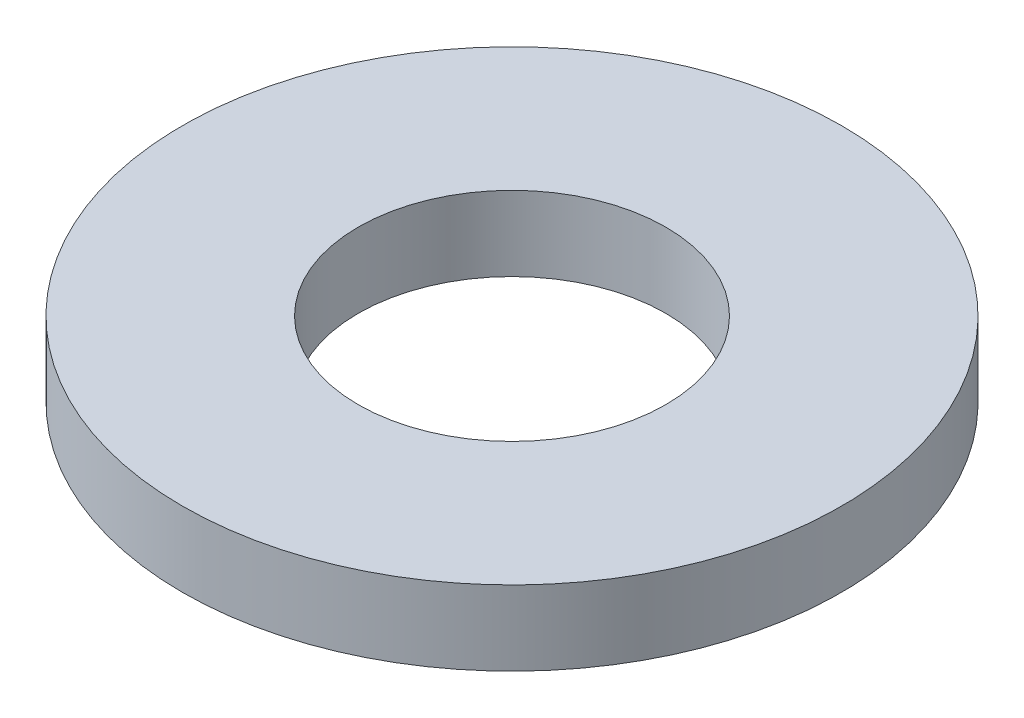
ISO-10303-21;
HEADER;
FILE_DESCRIPTION(('STEP AP214'),'2;1');
FILE_NAME('part.step','',(''),(''),'','','');
FILE_SCHEMA(('AUTOMOTIVE_DESIGN { 1 0 10303 214 1 1 1 1 }'));
ENDSEC;
DATA;
#1=APPLICATION_CONTEXT('core data for automotive mechanical design processes');
#2=APPLICATION_PROTOCOL_DEFINITION('international standard','automotive_design',2000,#1);
#3=PRODUCT_CONTEXT('',#1,'mechanical');
#4=PRODUCT('Part','Part','',(#3));
#5=PRODUCT_RELATED_PRODUCT_CATEGORY('part','',(#4));
#6=PRODUCT_DEFINITION_FORMATION('','',#4);
#7=PRODUCT_DEFINITION_CONTEXT('part definition',#1,'design');
#8=PRODUCT_DEFINITION('design','',#6,#7);
#9=PRODUCT_DEFINITION_SHAPE('','',#8);
#10=(LENGTH_UNIT() NAMED_UNIT(*) SI_UNIT(.MILLI.,.METRE.));
#11=(NAMED_UNIT(*) PLANE_ANGLE_UNIT() SI_UNIT($,.RADIAN.));
#12=(NAMED_UNIT(*) SI_UNIT($,.STERADIAN.) SOLID_ANGLE_UNIT());
#13=UNCERTAINTY_MEASURE_WITH_UNIT(LENGTH_MEASURE(1.E-05),#10,'distance_accuracy_value','');
#14=(GEOMETRIC_REPRESENTATION_CONTEXT(3) GLOBAL_UNCERTAINTY_ASSIGNED_CONTEXT((#13)) GLOBAL_UNIT_ASSIGNED_CONTEXT((#10,
#11,#12)) REPRESENTATION_CONTEXT('',''));
#15=CARTESIAN_POINT('',(0.,0.,0.));
#16=DIRECTION('',(0.,0.,1.));
#17=DIRECTION('',(1.,0.,0.));
#18=AXIS2_PLACEMENT_3D('',#15,#16,#17);
#19=CARTESIAN_POINT('',(0.,17.,0.));
#20=DIRECTION('',(0.,-1.,0.));
#21=DIRECTION('',(0.,0.,-1.));
#22=AXIS2_PLACEMENT_3D('',#19,#20,#21);
#23=CYLINDRICAL_SURFACE('',#22,75.);
#24=CARTESIAN_POINT('',(0.,17.,0.));
#25=DIRECTION('',(0.,1.,0.));
#26=DIRECTION('',(0.,0.,1.));
#27=AXIS2_PLACEMENT_3D('',#24,#25,#26);
#28=CIRCLE('',#27,75.);
#29=CARTESIAN_POINT('',(0.,17.,75.));
#30=VERTEX_POINT('',#29);
#31=EDGE_CURVE('E10',#30,#30,#28,.T.);
#32=ORIENTED_EDGE('',*,*,#31,.F.);
#33=EDGE_LOOP('',(#32));
#34=FACE_BOUND('',#33,.T.);
#35=CARTESIAN_POINT('',(0.,0.,0.));
#36=DIRECTION('',(0.,1.,0.));
#37=DIRECTION('',(0.,0.,1.));
#38=AXIS2_PLACEMENT_3D('',#35,#36,#37);
#39=CIRCLE('',#38,75.);
#40=CARTESIAN_POINT('',(0.,0.,75.));
#41=VERTEX_POINT('',#40);
#42=EDGE_CURVE('E37',#41,#41,#39,.T.);
#43=ORIENTED_EDGE('',*,*,#42,.T.);
#44=EDGE_LOOP('',(#43));
#45=FACE_BOUND('',#44,.T.);
#46=ADVANCED_FACE('F40',(#34,#45),#23,.T.);
#47=CARTESIAN_POINT('',(0.,17.,0.));
#48=DIRECTION('',(0.,1.,0.));
#49=DIRECTION('',(0.,0.,1.));
#50=AXIS2_PLACEMENT_3D('',#47,#48,#49);
#51=PLANE('',#50);
#52=CARTESIAN_POINT('',(0.,17.,0.));
#53=DIRECTION('',(0.,1.,0.));
#54=DIRECTION('',(0.,0.,1.));
#55=AXIS2_PLACEMENT_3D('',#52,#53,#54);
#56=CIRCLE('',#55,35.);
#57=CARTESIAN_POINT('',(0.,17.,35.));
#58=VERTEX_POINT('',#57);
#59=EDGE_CURVE('E50',#58,#58,#56,.T.);
#60=ORIENTED_EDGE('',*,*,#59,.F.);
#61=EDGE_LOOP('',(#60));
#62=FACE_BOUND('',#61,.T.);
#63=ORIENTED_EDGE('',*,*,#31,.T.);
#64=EDGE_LOOP('',(#63));
#65=FACE_BOUND('',#64,.T.);
#66=ADVANCED_FACE('F59',(#62,#65),#51,.T.);
#67=CARTESIAN_POINT('',(0.,0.,0.));
#68=DIRECTION('',(0.,1.,0.));
#69=DIRECTION('',(0.,0.,1.));
#70=AXIS2_PLACEMENT_3D('',#67,#68,#69);
#71=PLANE('',#70);
#72=CARTESIAN_POINT('',(0.,0.,0.));
#73=DIRECTION('',(0.,1.,0.));
#74=DIRECTION('',(0.,0.,1.));
#75=AXIS2_PLACEMENT_3D('',#72,#73,#74);
#76=CIRCLE('',#75,35.);
#77=CARTESIAN_POINT('',(0.,0.,35.));
#78=VERTEX_POINT('',#77);
#79=EDGE_CURVE('E47',#78,#78,#76,.T.);
#80=ORIENTED_EDGE('',*,*,#79,.T.);
#81=EDGE_LOOP('',(#80));
#82=FACE_BOUND('',#81,.T.);
#83=ORIENTED_EDGE('',*,*,#42,.F.);
#84=EDGE_LOOP('',(#83));
#85=FACE_BOUND('',#84,.T.);
#86=ADVANCED_FACE('F58',(#82,#85),#71,.F.);
#87=CARTESIAN_POINT('',(0.,17.,0.));
#88=DIRECTION('',(0.,-1.,0.));
#89=DIRECTION('',(0.,0.,-1.));
#90=AXIS2_PLACEMENT_3D('',#87,#88,#89);
#91=CYLINDRICAL_SURFACE('',#90,35.);
#92=ORIENTED_EDGE('',*,*,#59,.T.);
#93=EDGE_LOOP('',(#92));
#94=FACE_BOUND('',#93,.T.);
#95=ORIENTED_EDGE('',*,*,#79,.F.);
#96=EDGE_LOOP('',(#95));
#97=FACE_BOUND('',#96,.T.);
#98=ADVANCED_FACE('F54',(#94,#97),#91,.F.);
#99=CLOSED_SHELL('',(#46,#66,#86,#98));
#100=MANIFOLD_SOLID_BREP('B2',#99);
#101=ADVANCED_BREP_SHAPE_REPRESENTATION('',(#18,#100),#14);
#102=SHAPE_DEFINITION_REPRESENTATION(#9,#101);
ENDSEC;
END-ISO-10303-21;
